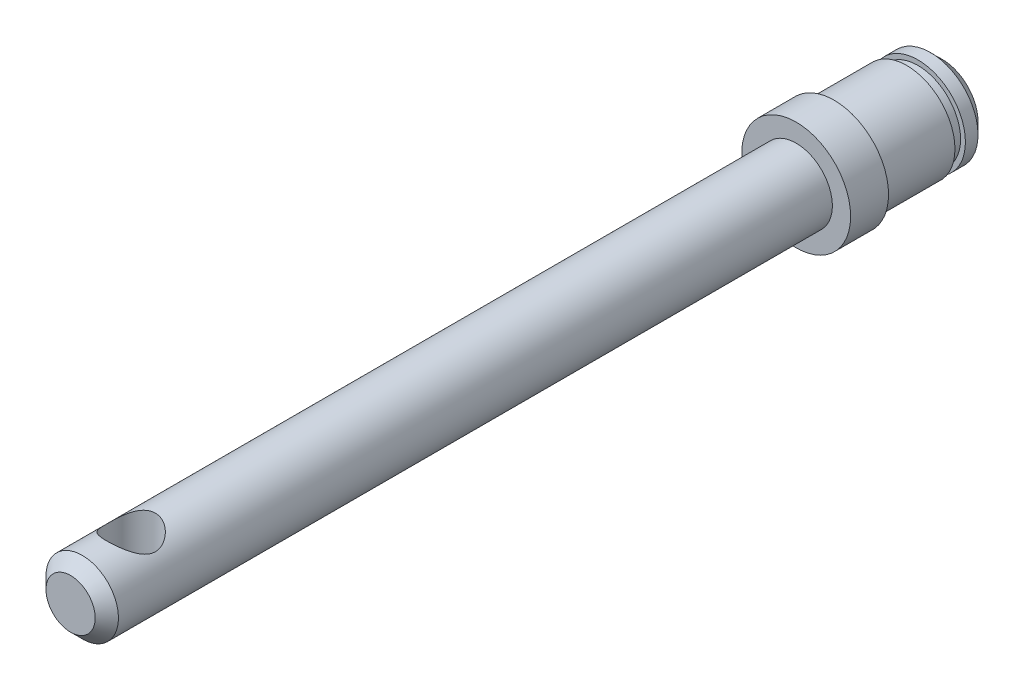
ISO-10303-21;
HEADER;
FILE_DESCRIPTION(('STEP AP214'),'2;1');
FILE_NAME('part.step','',(''),(''),'','','');
FILE_SCHEMA(('AUTOMOTIVE_DESIGN { 1 0 10303 214 1 1 1 1 }'));
ENDSEC;
DATA;
#1=APPLICATION_CONTEXT('core data for automotive mechanical design processes');
#2=APPLICATION_PROTOCOL_DEFINITION('international standard','automotive_design',2000,#1);
#3=PRODUCT_CONTEXT('',#1,'mechanical');
#4=PRODUCT('Part','Part','',(#3));
#5=PRODUCT_RELATED_PRODUCT_CATEGORY('part','',(#4));
#6=PRODUCT_DEFINITION_FORMATION('','',#4);
#7=PRODUCT_DEFINITION_CONTEXT('part definition',#1,'design');
#8=PRODUCT_DEFINITION('design','',#6,#7);
#9=PRODUCT_DEFINITION_SHAPE('','',#8);
#10=(LENGTH_UNIT() NAMED_UNIT(*) SI_UNIT(.MILLI.,.METRE.));
#11=(NAMED_UNIT(*) PLANE_ANGLE_UNIT() SI_UNIT($,.RADIAN.));
#12=(NAMED_UNIT(*) SI_UNIT($,.STERADIAN.) SOLID_ANGLE_UNIT());
#13=UNCERTAINTY_MEASURE_WITH_UNIT(LENGTH_MEASURE(1.E-05),#10,'distance_accuracy_value','');
#14=(GEOMETRIC_REPRESENTATION_CONTEXT(3) GLOBAL_UNCERTAINTY_ASSIGNED_CONTEXT((#13)) GLOBAL_UNIT_ASSIGNED_CONTEXT((#10,
#11,#12)) REPRESENTATION_CONTEXT('',''));
#15=CARTESIAN_POINT('',(0.,0.,0.));
#16=DIRECTION('',(0.,0.,1.));
#17=DIRECTION('',(1.,0.,0.));
#18=AXIS2_PLACEMENT_3D('',#15,#16,#17);
#19=CARTESIAN_POINT('',(0.,0.,-9.5758));
#20=DIRECTION('',(0.,0.,-1.));
#21=DIRECTION('',(-1.,0.,0.));
#22=AXIS2_PLACEMENT_3D('',#19,#20,#21);
#23=PLANE('',#22);
#24=CARTESIAN_POINT('',(0.,0.,-9.57579999993641));
#25=DIRECTION('',(0.,0.,1.));
#26=DIRECTION('',(1.,0.,0.));
#27=AXIS2_PLACEMENT_3D('',#24,#25,#26);
#28=CIRCLE('',#27,2.3494999999798);
#29=CARTESIAN_POINT('',(2.3494999999798,0.,-9.57579999993641));
#30=VERTEX_POINT('',#29);
#31=EDGE_CURVE('E17',#30,#30,#28,.T.);
#32=ORIENTED_EDGE('',*,*,#31,.F.);
#33=EDGE_LOOP('',(#32));
#34=FACE_BOUND('',#33,.T.);
#35=ADVANCED_FACE('F14',(#34),#23,.T.);
#36=CARTESIAN_POINT('',(0.,0.,-8.81380000009813));
#37=DIRECTION('',(0.,0.,1.));
#38=DIRECTION('',(1.,0.,0.));
#39=AXIS2_PLACEMENT_3D('',#36,#37,#38);
#40=CONICAL_SURFACE('',#39,3.11149999987492,0.785398163434747);
#41=ORIENTED_EDGE('',*,*,#31,.T.);
#42=EDGE_LOOP('',(#41));
#43=FACE_BOUND('',#42,.T.);
#44=CARTESIAN_POINT('',(0.,0.,-8.8138));
#45=DIRECTION('',(0.,0.,1.));
#46=DIRECTION('',(1.,0.,0.));
#47=AXIS2_PLACEMENT_3D('',#44,#45,#46);
#48=CIRCLE('',#47,3.1115);
#49=CARTESIAN_POINT('',(3.1115,0.,-8.8138));
#50=VERTEX_POINT('',#49);
#51=EDGE_CURVE('E33',#50,#50,#48,.T.);
#52=ORIENTED_EDGE('',*,*,#51,.F.);
#53=EDGE_LOOP('',(#52));
#54=FACE_BOUND('',#53,.T.);
#55=ADVANCED_FACE('F79',(#43,#54),#40,.T.);
#56=CARTESIAN_POINT('',(0.,0.,-9.5758));
#57=DIRECTION('',(0.,0.,1.));
#58=DIRECTION('',(1.,0.,0.));
#59=AXIS2_PLACEMENT_3D('',#56,#57,#58);
#60=CYLINDRICAL_SURFACE('',#59,3.1115);
#61=ORIENTED_EDGE('',*,*,#51,.T.);
#62=EDGE_LOOP('',(#61));
#63=FACE_BOUND('',#62,.T.);
#64=CARTESIAN_POINT('',(0.,0.,-7.9883));
#65=DIRECTION('',(0.,0.,1.));
#66=DIRECTION('',(1.,0.,0.));
#67=AXIS2_PLACEMENT_3D('',#64,#65,#66);
#68=CIRCLE('',#67,3.1115);
#69=CARTESIAN_POINT('',(3.1115,0.,-7.9883));
#70=VERTEX_POINT('',#69);
#71=EDGE_CURVE('E69',#70,#70,#68,.F.);
#72=ORIENTED_EDGE('',*,*,#71,.T.);
#73=EDGE_LOOP('',(#72));
#74=FACE_BOUND('',#73,.T.);
#75=ADVANCED_FACE('F87',(#63,#74),#60,.T.);
#76=CARTESIAN_POINT('',(0.,0.,-7.9883));
#77=DIRECTION('',(0.,0.,-1.));
#78=DIRECTION('',(-1.,0.,0.));
#79=AXIS2_PLACEMENT_3D('',#76,#77,#78);
#80=PLANE('',#79);
#81=CARTESIAN_POINT('',(0.,0.,-7.9883));
#82=DIRECTION('',(0.,0.,1.));
#83=DIRECTION('',(1.,0.,0.));
#84=AXIS2_PLACEMENT_3D('',#81,#82,#83);
#85=CIRCLE('',#84,2.794);
#86=CARTESIAN_POINT('',(2.794,0.,-7.9883));
#87=VERTEX_POINT('',#86);
#88=EDGE_CURVE('E67',#87,#87,#85,.T.);
#89=ORIENTED_EDGE('',*,*,#88,.F.);
#90=EDGE_LOOP('',(#89));
#91=FACE_BOUND('',#90,.T.);
#92=ORIENTED_EDGE('',*,*,#71,.F.);
#93=EDGE_LOOP('',(#92));
#94=FACE_BOUND('',#93,.T.);
#95=ADVANCED_FACE('F91',(#91,#94),#80,.F.);
#96=CARTESIAN_POINT('',(0.,0.,-7.9883));
#97=DIRECTION('',(0.,0.,1.));
#98=DIRECTION('',(1.,0.,0.));
#99=AXIS2_PLACEMENT_3D('',#96,#97,#98);
#100=CYLINDRICAL_SURFACE('',#99,2.794);
#101=CARTESIAN_POINT('',(0.,0.,-7.2517));
#102=DIRECTION('',(0.,0.,1.));
#103=DIRECTION('',(1.,0.,0.));
#104=AXIS2_PLACEMENT_3D('',#101,#102,#103);
#105=CIRCLE('',#104,2.794);
#106=CARTESIAN_POINT('',(2.794,0.,-7.2517));
#107=VERTEX_POINT('',#106);
#108=EDGE_CURVE('E64',#107,#107,#105,.T.);
#109=ORIENTED_EDGE('',*,*,#108,.F.);
#110=EDGE_LOOP('',(#109));
#111=FACE_BOUND('',#110,.T.);
#112=ORIENTED_EDGE('',*,*,#88,.T.);
#113=EDGE_LOOP('',(#112));
#114=FACE_BOUND('',#113,.T.);
#115=ADVANCED_FACE('F96',(#111,#114),#100,.T.);
#116=CARTESIAN_POINT('',(0.,0.,-7.2517));
#117=DIRECTION('',(0.,0.,-1.));
#118=DIRECTION('',(-1.,0.,0.));
#119=AXIS2_PLACEMENT_3D('',#116,#117,#118);
#120=PLANE('',#119);
#121=ORIENTED_EDGE('',*,*,#108,.T.);
#122=EDGE_LOOP('',(#121));
#123=FACE_BOUND('',#122,.T.);
#124=CARTESIAN_POINT('',(0.,0.,-7.2517));
#125=DIRECTION('',(0.,0.,1.));
#126=DIRECTION('',(1.,0.,0.));
#127=AXIS2_PLACEMENT_3D('',#124,#125,#126);
#128=CIRCLE('',#127,3.1623);
#129=CARTESIAN_POINT('',(3.1623,0.,-7.2517));
#130=VERTEX_POINT('',#129);
#131=EDGE_CURVE('E61',#130,#130,#128,.T.);
#132=ORIENTED_EDGE('',*,*,#131,.F.);
#133=EDGE_LOOP('',(#132));
#134=FACE_BOUND('',#133,.T.);
#135=ADVANCED_FACE('F100',(#123,#134),#120,.T.);
#136=CARTESIAN_POINT('',(0.,0.,-7.2517));
#137=DIRECTION('',(0.,0.,1.));
#138=DIRECTION('',(1.,0.,0.));
#139=AXIS2_PLACEMENT_3D('',#136,#137,#138);
#140=CYLINDRICAL_SURFACE('',#139,3.1623);
#141=ORIENTED_EDGE('',*,*,#131,.T.);
#142=EDGE_LOOP('',(#141));
#143=FACE_BOUND('',#142,.T.);
#144=CARTESIAN_POINT('',(0.,0.,-2.4892));
#145=DIRECTION('',(0.,0.,1.));
#146=DIRECTION('',(1.,0.,0.));
#147=AXIS2_PLACEMENT_3D('',#144,#145,#146);
#148=CIRCLE('',#147,3.1623);
#149=CARTESIAN_POINT('',(3.1623,0.,-2.4892));
#150=VERTEX_POINT('',#149);
#151=EDGE_CURVE('E58',#150,#150,#148,.F.);
#152=ORIENTED_EDGE('',*,*,#151,.T.);
#153=EDGE_LOOP('',(#152));
#154=FACE_BOUND('',#153,.T.);
#155=ADVANCED_FACE('F104',(#143,#154),#140,.T.);
#156=CARTESIAN_POINT('',(0.,0.,-2.4892));
#157=DIRECTION('',(0.,0.,1.));
#158=DIRECTION('',(1.,0.,0.));
#159=AXIS2_PLACEMENT_3D('',#156,#157,#158);
#160=PLANE('',#159);
#161=ORIENTED_EDGE('',*,*,#151,.F.);
#162=EDGE_LOOP('',(#161));
#163=FACE_BOUND('',#162,.T.);
#164=CARTESIAN_POINT('',(0.,0.,-2.4892));
#165=DIRECTION('',(0.,0.,1.));
#166=DIRECTION('',(1.,0.,0.));
#167=AXIS2_PLACEMENT_3D('',#164,#165,#166);
#168=CIRCLE('',#167,3.571875);
#169=CARTESIAN_POINT('',(3.571875,0.,-2.4892));
#170=VERTEX_POINT('',#169);
#171=EDGE_CURVE('E55',#170,#170,#168,.T.);
#172=ORIENTED_EDGE('',*,*,#171,.F.);
#173=EDGE_LOOP('',(#172));
#174=FACE_BOUND('',#173,.T.);
#175=ADVANCED_FACE('F108',(#163,#174),#160,.F.);
#176=CARTESIAN_POINT('',(0.,0.,47.5742));
#177=DIRECTION('',(0.,0.,1.));
#178=DIRECTION('',(1.,0.,0.));
#179=AXIS2_PLACEMENT_3D('',#176,#177,#178);
#180=PLANE('',#179);
#181=CARTESIAN_POINT('',(0.,0.,47.5741999999855));
#182=DIRECTION('',(0.,0.,-1.));
#183=DIRECTION('',(-1.,0.,0.));
#184=AXIS2_PLACEMENT_3D('',#181,#182,#183);
#185=CIRCLE('',#184,1.61289999999781);
#186=CARTESIAN_POINT('',(-1.61289999999781,0.,47.5741999999855));
#187=VERTEX_POINT('',#186);
#188=EDGE_CURVE('E52',#187,#187,#185,.T.);
#189=ORIENTED_EDGE('',*,*,#188,.F.);
#190=EDGE_LOOP('',(#189));
#191=FACE_BOUND('',#190,.T.);
#192=ADVANCED_FACE('F112',(#191),#180,.T.);
#193=CARTESIAN_POINT('',(0.,0.,-2.4892));
#194=DIRECTION('',(0.,0.,1.));
#195=DIRECTION('',(1.,0.,0.));
#196=AXIS2_PLACEMENT_3D('',#193,#194,#195);
#197=CYLINDRICAL_SURFACE('',#196,3.571875);
#198=ORIENTED_EDGE('',*,*,#171,.T.);
#199=EDGE_LOOP('',(#198));
#200=FACE_BOUND('',#199,.T.);
#201=CARTESIAN_POINT('',(0.,0.,0.));
#202=DIRECTION('',(0.,0.,1.));
#203=DIRECTION('',(1.,0.,0.));
#204=AXIS2_PLACEMENT_3D('',#201,#202,#203);
#205=CIRCLE('',#204,3.571875);
#206=CARTESIAN_POINT('',(3.571875,0.,0.));
#207=VERTEX_POINT('',#206);
#208=EDGE_CURVE('E49',#207,#207,#205,.T.);
#209=ORIENTED_EDGE('',*,*,#208,.F.);
#210=EDGE_LOOP('',(#209));
#211=FACE_BOUND('',#210,.T.);
#212=ADVANCED_FACE('F116',(#200,#211),#197,.T.);
#213=CARTESIAN_POINT('',(0.,0.,46.8121999999767));
#214=DIRECTION('',(0.,0.,-1.));
#215=DIRECTION('',(-1.,0.,0.));
#216=AXIS2_PLACEMENT_3D('',#213,#214,#215);
#217=CONICAL_SURFACE('',#216,2.37490000000662,0.785398163397448);
#218=ORIENTED_EDGE('',*,*,#188,.T.);
#219=EDGE_LOOP('',(#218));
#220=FACE_BOUND('',#219,.T.);
#221=CARTESIAN_POINT('',(0.,0.,46.8122));
#222=DIRECTION('',(0.,0.,-1.));
#223=DIRECTION('',(-1.,0.,0.));
#224=AXIS2_PLACEMENT_3D('',#221,#222,#223);
#225=CIRCLE('',#224,2.3749);
#226=CARTESIAN_POINT('',(-2.3749,0.,46.8122));
#227=VERTEX_POINT('',#226);
#228=EDGE_CURVE('E26',#227,#227,#225,.T.);
#229=ORIENTED_EDGE('',*,*,#228,.F.);
#230=EDGE_LOOP('',(#229));
#231=FACE_BOUND('',#230,.T.);
#232=ADVANCED_FACE('F120',(#220,#231),#217,.T.);
#233=CARTESIAN_POINT('',(0.,0.,0.));
#234=DIRECTION('',(0.,0.,1.));
#235=DIRECTION('',(1.,0.,0.));
#236=AXIS2_PLACEMENT_3D('',#233,#234,#235);
#237=PLANE('',#236);
#238=CARTESIAN_POINT('',(0.,0.,0.));
#239=DIRECTION('',(0.,0.,-1.));
#240=DIRECTION('',(-1.,0.,0.));
#241=AXIS2_PLACEMENT_3D('',#238,#239,#240);
#242=CIRCLE('',#241,2.3749);
#243=CARTESIAN_POINT('',(-2.3749,0.,0.));
#244=VERTEX_POINT('',#243);
#245=EDGE_CURVE('E21',#244,#244,#242,.F.);
#246=ORIENTED_EDGE('',*,*,#245,.F.);
#247=EDGE_LOOP('',(#246));
#248=FACE_BOUND('',#247,.T.);
#249=ORIENTED_EDGE('',*,*,#208,.T.);
#250=EDGE_LOOP('',(#249));
#251=FACE_BOUND('',#250,.T.);
#252=ADVANCED_FACE('F123',(#248,#251),#237,.T.);
#253=CARTESIAN_POINT('',(0.,-3.571875,43.60545));
#254=DIRECTION('',(0.,1.,0.));
#255=DIRECTION('',(0.,0.,1.));
#256=AXIS2_PLACEMENT_3D('',#253,#254,#255);
#257=CYLINDRICAL_SURFACE('',#256,1.5875);
#258=CARTESIAN_POINT('',(0.,2.3749,45.19295));
#259=CARTESIAN_POINT('',(-0.0796285021727966,2.37489427166207,45.1929439134093));
#260=CARTESIAN_POINT('',(-0.159333187346092,2.3708547437601,45.1869178453679));
#261=CARTESIAN_POINT('',(-0.316246788253907,2.35507625489168,45.1631617849446));
#262=CARTESIAN_POINT('',(-0.393451638249593,2.34332535323937,45.1454136412255));
#263=CARTESIAN_POINT('',(-0.542790518515763,2.31328830758023,45.0993083312295));
#264=CARTESIAN_POINT('',(-0.614948378456795,2.29503576257873,45.0710056736267));
#265=CARTESIAN_POINT('',(-0.753178545236462,2.25346165524091,45.0050040485006));
#266=CARTESIAN_POINT('',(-0.819251194999285,2.23014037879558,44.9673056109087));
#267=CARTESIAN_POINT('',(-0.949807131451189,2.17792784028168,44.8800881288627));
#268=CARTESIAN_POINT('',(-1.01367601133952,2.14873138397025,44.8298358883516));
#269=CARTESIAN_POINT('',(-1.13266066753279,2.0884656766868,44.7206931180195));
#270=CARTESIAN_POINT('',(-1.18776336726205,2.05739372150985,44.6617899306125));
#271=CARTESIAN_POINT('',(-1.29659427145063,1.99089626995362,44.5261680967343));
#272=CARTESIAN_POINT('',(-1.34871636553572,1.95556248733199,44.4481056626616));
#273=CARTESIAN_POINT('',(-1.43904349853149,1.89008374794265,44.2823403381314));
#274=CARTESIAN_POINT('',(-1.4772725865024,1.85992987284409,44.1946544520516));
#275=CARTESIAN_POINT('',(-1.52904517834333,1.81740283377534,44.0377472795276));
#276=CARTESIAN_POINT('',(-1.54653236351236,1.80240921282223,43.9705447171603));
#277=CARTESIAN_POINT('',(-1.57261168441343,1.77970474695812,43.8332848433952));
#278=CARTESIAN_POINT('',(-1.58121930044462,1.7719812296935,43.763232722255));
#279=CARTESIAN_POINT('',(-1.58899802612375,1.76501215254764,43.6218716388384));
#280=CARTESIAN_POINT('',(-1.58812985724121,1.76580188116326,43.5505586693621));
#281=CARTESIAN_POINT('',(-1.57692650593038,1.77581049841768,43.4092572197684));
#282=CARTESIAN_POINT('',(-1.56658327442516,1.7850365537139,43.3392699174096));
#283=CARTESIAN_POINT('',(-1.53778680769931,1.80988877384798,43.2056567626746));
#284=CARTESIAN_POINT('',(-1.51972103829905,1.82520699487101,43.1418863605764));
#285=CARTESIAN_POINT('',(-1.47635800673587,1.86045582345457,43.0182351850859));
#286=CARTESIAN_POINT('',(-1.45105836975688,1.88038794530891,42.9583556969829));
#287=CARTESIAN_POINT('',(-1.38804369169894,1.92751840139636,42.8311724358925));
#288=CARTESIAN_POINT('',(-1.34884877883874,1.95536954816995,42.7648460457442));
#289=CARTESIAN_POINT('',(-1.26169992826936,2.01270750683002,42.6389401049234));
#290=CARTESIAN_POINT('',(-1.21373539144903,2.04219626760565,42.5793688613398));
#291=CARTESIAN_POINT('',(-1.09822042057742,2.10697571698643,42.4553504562286));
#292=CARTESIAN_POINT('',(-1.02867941502371,2.14213147691545,42.3926663982129));
#293=CARTESIAN_POINT('',(-0.87829590652397,2.20804612806214,42.2797162875604));
#294=CARTESIAN_POINT('',(-0.797461070213304,2.23880797360637,42.2294418743602));
#295=CARTESIAN_POINT('',(-0.642794196366182,2.28740091649053,42.151857840345));
#296=CARTESIAN_POINT('',(-0.570673934887535,2.30658392602361,42.1219812810788));
#297=CARTESIAN_POINT('',(-0.421590346714549,2.33841465201831,42.0729550712348));
#298=CARTESIAN_POINT('',(-0.344638477425361,2.35107721947041,42.05378103609));
#299=CARTESIAN_POINT('',(-0.222529004084351,2.36486476954346,42.0329936390966));
#300=CARTESIAN_POINT('',(-0.178308116016056,2.36861511899109,42.0273651451537));
#301=CARTESIAN_POINT('',(-0.0893995612791168,2.37363462559172,42.0198411908061));
#302=CARTESIAN_POINT('',(-0.0447117904210668,2.37490321648955,42.0179465823498));
#303=CARTESIAN_POINT('',(0.0796285021727959,2.37489427166207,42.0179560865907));
#304=CARTESIAN_POINT('',(0.159333187346092,2.3708547437601,42.0239821546321));
#305=CARTESIAN_POINT('',(0.316246788253906,2.35507625489168,42.0477382150553));
#306=CARTESIAN_POINT('',(0.393451638249593,2.34332535323937,42.0654863587745));
#307=CARTESIAN_POINT('',(0.542790518515763,2.31328830758023,42.1115916687705));
#308=CARTESIAN_POINT('',(0.614948378456795,2.29503576257873,42.1398943263733));
#309=CARTESIAN_POINT('',(0.753178545236463,2.25346165524091,42.2058959514994));
#310=CARTESIAN_POINT('',(0.819251194999285,2.23014037879558,42.2435943890913));
#311=CARTESIAN_POINT('',(0.949807131451189,2.17792784028168,42.3308118711373));
#312=CARTESIAN_POINT('',(1.01367601133952,2.14873138397025,42.3810641116484));
#313=CARTESIAN_POINT('',(1.13266066753279,2.0884656766868,42.4902068819805));
#314=CARTESIAN_POINT('',(1.18776336726205,2.05739372150985,42.5491100693874));
#315=CARTESIAN_POINT('',(1.29659427145063,1.99089626995362,42.6847319032657));
#316=CARTESIAN_POINT('',(1.34871636553572,1.95556248733199,42.7627943373384));
#317=CARTESIAN_POINT('',(1.43904349853149,1.89008374794265,42.9285596618686));
#318=CARTESIAN_POINT('',(1.4772725865024,1.85992987284409,43.0162455479484));
#319=CARTESIAN_POINT('',(1.52904517834333,1.81740283377534,43.1731527204724));
#320=CARTESIAN_POINT('',(1.54653236351236,1.80240921282223,43.2403552828397));
#321=CARTESIAN_POINT('',(1.57261168441343,1.77970474695812,43.3776151566048));
#322=CARTESIAN_POINT('',(1.58121930044462,1.7719812296935,43.447667277745));
#323=CARTESIAN_POINT('',(1.58899802612375,1.76501215254764,43.5890283611616));
#324=CARTESIAN_POINT('',(1.58812985724121,1.76580188116326,43.6603413306379));
#325=CARTESIAN_POINT('',(1.57692650593038,1.77581049841768,43.8016427802316));
#326=CARTESIAN_POINT('',(1.56658327442517,1.7850365537139,43.8716300825904));
#327=CARTESIAN_POINT('',(1.53778680769931,1.80988877384798,44.0052432373254));
#328=CARTESIAN_POINT('',(1.51972103829905,1.825206994871,44.0690136394236));
#329=CARTESIAN_POINT('',(1.47635800673587,1.86045582345457,44.192664814914));
#330=CARTESIAN_POINT('',(1.45105836975689,1.88038794530891,44.2525443030171));
#331=CARTESIAN_POINT('',(1.38804369169894,1.92751840139636,44.3797275641075));
#332=CARTESIAN_POINT('',(1.34884877883874,1.95536954816995,44.4460539542558));
#333=CARTESIAN_POINT('',(1.26169992826936,2.01270750683002,44.5719598950766));
#334=CARTESIAN_POINT('',(1.21373539144903,2.04219626760564,44.6315311386602));
#335=CARTESIAN_POINT('',(1.09822042057742,2.10697571698643,44.7555495437714));
#336=CARTESIAN_POINT('',(1.02867941502371,2.14213147691544,44.8182336017871));
#337=CARTESIAN_POINT('',(0.87829590652398,2.20804612806214,44.9311837124396));
#338=CARTESIAN_POINT('',(0.797461070213316,2.23880797360636,44.9814581256398));
#339=CARTESIAN_POINT('',(0.642794196366197,2.28740091649053,45.059042159655));
#340=CARTESIAN_POINT('',(0.57067393488755,2.30658392602361,45.0889187189212));
#341=CARTESIAN_POINT('',(0.421590346714565,2.33841465201831,45.1379449287651));
#342=CARTESIAN_POINT('',(0.344638477425378,2.3510772194704,45.15711896391));
#343=CARTESIAN_POINT('',(0.222529004084365,2.36486476954346,45.1779063609034));
#344=CARTESIAN_POINT('',(0.178308116016067,2.36861511899109,45.1835348548463));
#345=CARTESIAN_POINT('',(0.0893995612791212,2.37363462559172,45.1910588091939));
#346=CARTESIAN_POINT('',(0.0447117904210687,2.37490321648955,45.1929534176502));
#347=CARTESIAN_POINT('',(0.,2.3749,45.19295));
#348=B_SPLINE_CURVE_WITH_KNOTS('',3,(#258,#259,#260,#261,#262,#263,#264,#265,#266,#267,#268,
#269,#270,#271,#272,#273,#274,#275,#276,#277,#278,#279,#280,#281,#282,#283,#284,#285,#286,#287,
#288,#289,#290,#291,#292,#293,#294,#295,#296,#297,#298,#299,#300,#301,#302,#303,#304,#305,#306,
#307,#308,#309,#310,#311,#312,#313,#314,#315,#316,#317,#318,#319,#320,#321,#322,#323,#324,#325,
#326,#327,#328,#329,#330,#331,#332,#333,#334,#335,#336,#337,#338,#339,#340,#341,#342,#343,#344,
#345,#346,#347),.UNSPECIFIED.,.T.,.F.,(4,2,2,2,2,2,2,2,2,2,2,2,2,2,2,2,2,2,2,2,2,2,2,2,2,2,2,2,
2,2,2,2,2,2,2,2,2,2,2,2,2,2,2,2,4),(0.,0.238700395852421,0.477771282535445,0.71562421428543,
0.95346373392742,1.21155549797826,1.47002872073382,1.76952408912618,2.06849852769238,
2.28077891750231,2.49268859719911,2.70547700634111,2.9184463472867,3.12179507761272,
3.32521064236503,3.57012288877609,3.815333120713,4.1139409115089,4.41234697329097,
4.65252034508975,4.89214425005817,5.02614510978654,5.16017654051243,5.39887693636485,
5.63794782304788,5.87580075479786,6.11364027443985,6.37173203849069,6.63020526124625,
6.92970062963861,7.22867506820481,7.44095545801474,7.65286513771153,7.86565354685354,
8.07862288779913,8.28197161812515,8.48538718287745,8.73029942928851,8.97550966122542,
9.27411745202132,9.57252351380338,9.81269688560216,10.0523207905706,10.186321650299,
10.3203530810249),.UNSPECIFIED.);
#349=CARTESIAN_POINT('',(0.,2.3749,45.19295));
#350=VERTEX_POINT('',#349);
#351=EDGE_CURVE('E44',#350,#350,#348,.T.);
#352=ORIENTED_EDGE('',*,*,#351,.F.);
#353=EDGE_LOOP('',(#352));
#354=FACE_BOUND('',#353,.T.);
#355=CARTESIAN_POINT('',(0.,-2.3749,45.19295));
#356=CARTESIAN_POINT('',(0.079628502172797,-2.37489427166208,45.1929439134093));
#357=CARTESIAN_POINT('',(0.159333187346093,-2.3708547437601,45.1869178453679));
#358=CARTESIAN_POINT('',(0.316246788253907,-2.35507625489168,45.1631617849446));
#359=CARTESIAN_POINT('',(0.393451638249594,-2.34332535323937,45.1454136412255));
#360=CARTESIAN_POINT('',(0.542790518515763,-2.31328830758023,45.0993083312295));
#361=CARTESIAN_POINT('',(0.614948378456796,-2.29503576257873,45.0710056736267));
#362=CARTESIAN_POINT('',(0.753178545236462,-2.25346165524091,45.0050040485006));
#363=CARTESIAN_POINT('',(0.819251194999285,-2.23014037879558,44.9673056109087));
#364=CARTESIAN_POINT('',(0.949807131451189,-2.17792784028168,44.8800881288627));
#365=CARTESIAN_POINT('',(1.01367601133952,-2.14873138397025,44.8298358883516));
#366=CARTESIAN_POINT('',(1.13266066753279,-2.0884656766868,44.7206931180195));
#367=CARTESIAN_POINT('',(1.18776336726205,-2.05739372150985,44.6617899306125));
#368=CARTESIAN_POINT('',(1.29659427145063,-1.99089626995362,44.5261680967343));
#369=CARTESIAN_POINT('',(1.34871636553572,-1.95556248733199,44.4481056626616));
#370=CARTESIAN_POINT('',(1.43904349853149,-1.89008374794265,44.2823403381314));
#371=CARTESIAN_POINT('',(1.4772725865024,-1.85992987284409,44.1946544520516));
#372=CARTESIAN_POINT('',(1.52904517834333,-1.81740283377534,44.0377472795276));
#373=CARTESIAN_POINT('',(1.54653236351237,-1.80240921282223,43.9705447171602));
#374=CARTESIAN_POINT('',(1.57261168441344,-1.77970474695812,43.8332848433952));
#375=CARTESIAN_POINT('',(1.58121930044462,-1.7719812296935,43.763232722255));
#376=CARTESIAN_POINT('',(1.58899802612375,-1.76501215254764,43.6218716388384));
#377=CARTESIAN_POINT('',(1.58812985724121,-1.76580188116326,43.5505586693621));
#378=CARTESIAN_POINT('',(1.57692650593038,-1.77581049841768,43.4092572197684));
#379=CARTESIAN_POINT('',(1.56658327442516,-1.7850365537139,43.3392699174096));
#380=CARTESIAN_POINT('',(1.53778680769931,-1.80988877384798,43.2056567626746));
#381=CARTESIAN_POINT('',(1.51972103829905,-1.82520699487101,43.1418863605764));
#382=CARTESIAN_POINT('',(1.47635800673587,-1.86045582345457,43.0182351850859));
#383=CARTESIAN_POINT('',(1.45105836975688,-1.88038794530891,42.9583556969829));
#384=CARTESIAN_POINT('',(1.38804369169894,-1.92751840139636,42.8311724358925));
#385=CARTESIAN_POINT('',(1.34884877883874,-1.95536954816995,42.7648460457442));
#386=CARTESIAN_POINT('',(1.26169992826936,-2.01270750683002,42.6389401049234));
#387=CARTESIAN_POINT('',(1.21373539144903,-2.04219626760565,42.5793688613398));
#388=CARTESIAN_POINT('',(1.09822042057742,-2.10697571698643,42.4553504562286));
#389=CARTESIAN_POINT('',(1.0286794150237,-2.14213147691545,42.3926663982129));
#390=CARTESIAN_POINT('',(0.878295906523966,-2.20804612806214,42.2797162875604));
#391=CARTESIAN_POINT('',(0.797461070213302,-2.23880797360637,42.2294418743602));
#392=CARTESIAN_POINT('',(0.642794196366183,-2.28740091649053,42.151857840345));
#393=CARTESIAN_POINT('',(0.570673934887537,-2.30658392602361,42.1219812810788));
#394=CARTESIAN_POINT('',(0.421590346714551,-2.33841465201831,42.0729550712348));
#395=CARTESIAN_POINT('',(0.344638477425362,-2.35107721947041,42.05378103609));
#396=CARTESIAN_POINT('',(0.22252900408435,-2.36486476954346,42.0329936390966));
#397=CARTESIAN_POINT('',(0.178308116016056,-2.36861511899109,42.0273651451537));
#398=CARTESIAN_POINT('',(0.0893995612791169,-2.37363462559172,42.0198411908061));
#399=CARTESIAN_POINT('',(0.0447117904210671,-2.37490321648955,42.0179465823498));
#400=CARTESIAN_POINT('',(-0.0796285021727957,-2.37489427166208,42.0179560865907));
#401=CARTESIAN_POINT('',(-0.159333187346092,-2.3708547437601,42.0239821546321));
#402=CARTESIAN_POINT('',(-0.316246788253906,-2.35507625489168,42.0477382150553));
#403=CARTESIAN_POINT('',(-0.393451638249593,-2.34332535323937,42.0654863587745));
#404=CARTESIAN_POINT('',(-0.542790518515762,-2.31328830758023,42.1115916687705));
#405=CARTESIAN_POINT('',(-0.614948378456795,-2.29503576257873,42.1398943263733));
#406=CARTESIAN_POINT('',(-0.753178545236462,-2.25346165524091,42.2058959514994));
#407=CARTESIAN_POINT('',(-0.819251194999284,-2.23014037879558,42.2435943890913));
#408=CARTESIAN_POINT('',(-0.949807131451189,-2.17792784028168,42.3308118711373));
#409=CARTESIAN_POINT('',(-1.01367601133952,-2.14873138397025,42.3810641116484));
#410=CARTESIAN_POINT('',(-1.13266066753279,-2.0884656766868,42.4902068819805));
#411=CARTESIAN_POINT('',(-1.18776336726205,-2.05739372150985,42.5491100693874));
#412=CARTESIAN_POINT('',(-1.29659427145063,-1.99089626995362,42.6847319032657));
#413=CARTESIAN_POINT('',(-1.34871636553572,-1.95556248733199,42.7627943373384));
#414=CARTESIAN_POINT('',(-1.43904349853149,-1.89008374794265,42.9285596618686));
#415=CARTESIAN_POINT('',(-1.4772725865024,-1.85992987284409,43.0162455479484));
#416=CARTESIAN_POINT('',(-1.52904517834333,-1.81740283377534,43.1731527204724));
#417=CARTESIAN_POINT('',(-1.54653236351237,-1.80240921282223,43.2403552828398));
#418=CARTESIAN_POINT('',(-1.57261168441344,-1.77970474695812,43.3776151566048));
#419=CARTESIAN_POINT('',(-1.58121930044462,-1.7719812296935,43.447667277745));
#420=CARTESIAN_POINT('',(-1.58899802612375,-1.76501215254764,43.5890283611616));
#421=CARTESIAN_POINT('',(-1.58812985724121,-1.76580188116326,43.6603413306379));
#422=CARTESIAN_POINT('',(-1.57692650593038,-1.77581049841768,43.8016427802316));
#423=CARTESIAN_POINT('',(-1.56658327442516,-1.7850365537139,43.8716300825904));
#424=CARTESIAN_POINT('',(-1.53778680769931,-1.80988877384798,44.0052432373254));
#425=CARTESIAN_POINT('',(-1.51972103829905,-1.82520699487101,44.0690136394236));
#426=CARTESIAN_POINT('',(-1.47635800673587,-1.86045582345457,44.192664814914));
#427=CARTESIAN_POINT('',(-1.45105836975688,-1.88038794530891,44.2525443030171));
#428=CARTESIAN_POINT('',(-1.38804369169894,-1.92751840139636,44.3797275641075));
#429=CARTESIAN_POINT('',(-1.34884877883874,-1.95536954816995,44.4460539542558));
#430=CARTESIAN_POINT('',(-1.26169992826936,-2.01270750683002,44.5719598950766));
#431=CARTESIAN_POINT('',(-1.21373539144903,-2.04219626760565,44.6315311386602));
#432=CARTESIAN_POINT('',(-1.09822042057742,-2.10697571698643,44.7555495437714));
#433=CARTESIAN_POINT('',(-1.02867941502371,-2.14213147691544,44.8182336017871));
#434=CARTESIAN_POINT('',(-0.878295906523972,-2.20804612806214,44.9311837124396));
#435=CARTESIAN_POINT('',(-0.797461070213305,-2.23880797360637,44.9814581256398));
#436=CARTESIAN_POINT('',(-0.642794196366183,-2.28740091649053,45.059042159655));
#437=CARTESIAN_POINT('',(-0.570673934887537,-2.30658392602361,45.0889187189212));
#438=CARTESIAN_POINT('',(-0.421590346714551,-2.33841465201831,45.1379449287651));
#439=CARTESIAN_POINT('',(-0.344638477425362,-2.35107721947041,45.15711896391));
#440=CARTESIAN_POINT('',(-0.22252900408435,-2.36486476954346,45.1779063609034));
#441=CARTESIAN_POINT('',(-0.178308116016055,-2.36861511899109,45.1835348548463));
#442=CARTESIAN_POINT('',(-0.0893995612791154,-2.37363462559172,45.1910588091939));
#443=CARTESIAN_POINT('',(-0.0447117904210655,-2.37490321648955,45.1929534176502));
#444=CARTESIAN_POINT('',(0.,-2.3749,45.19295));
#445=B_SPLINE_CURVE_WITH_KNOTS('',3,(#355,#356,#357,#358,#359,#360,#361,#362,#363,#364,#365,
#366,#367,#368,#369,#370,#371,#372,#373,#374,#375,#376,#377,#378,#379,#380,#381,#382,#383,#384,
#385,#386,#387,#388,#389,#390,#391,#392,#393,#394,#395,#396,#397,#398,#399,#400,#401,#402,#403,
#404,#405,#406,#407,#408,#409,#410,#411,#412,#413,#414,#415,#416,#417,#418,#419,#420,#421,#422,
#423,#424,#425,#426,#427,#428,#429,#430,#431,#432,#433,#434,#435,#436,#437,#438,#439,#440,#441,
#442,#443,#444),.UNSPECIFIED.,.T.,.F.,(4,2,2,2,2,2,2,2,2,2,2,2,2,2,2,2,2,2,2,2,2,2,2,2,2,2,2,2,
2,2,2,2,2,2,2,2,2,2,2,2,2,2,2,2,4),(0.,0.238700395852421,0.477771282535445,0.71562421428543,
0.953463733927419,1.21155549797826,1.47002872073382,1.76952408912618,2.06849852769238,
2.28077891750232,2.49268859719911,2.70547700634111,2.9184463472867,3.12179507761272,
3.32521064236503,3.57012288877609,3.815333120713,4.11394091150891,4.41234697329097,
4.65252034508974,4.89214425005817,5.02614510978654,5.16017654051243,5.39887693636485,
5.63794782304788,5.87580075479786,6.11364027443985,6.37173203849069,6.63020526124625,
6.92970062963861,7.22867506820481,7.44095545801475,7.65286513771154,7.86565354685354,
8.07862288779913,8.28197161812515,8.48538718287746,8.73029942928852,8.97550966122543,
9.27411745202133,9.5725235138034,9.81269688560218,10.0523207905706,10.186321650299,
10.3203530810249),.UNSPECIFIED.);
#446=CARTESIAN_POINT('',(0.,-2.3749,45.19295));
#447=VERTEX_POINT('',#446);
#448=EDGE_CURVE('E10',#447,#447,#445,.T.);
#449=ORIENTED_EDGE('',*,*,#448,.F.);
#450=EDGE_LOOP('',(#449));
#451=FACE_BOUND('',#450,.T.);
#452=ADVANCED_FACE('F36',(#354,#451),#257,.F.);
#453=CARTESIAN_POINT('',(0.,0.,47.5742));
#454=DIRECTION('',(0.,0.,-1.));
#455=DIRECTION('',(-1.,0.,0.));
#456=AXIS2_PLACEMENT_3D('',#453,#454,#455);
#457=CYLINDRICAL_SURFACE('',#456,2.3749);
#458=ORIENTED_EDGE('',*,*,#228,.T.);
#459=EDGE_LOOP('',(#458));
#460=FACE_BOUND('',#459,.T.);
#461=ORIENTED_EDGE('',*,*,#448,.T.);
#462=EDGE_LOOP('',(#461));
#463=FACE_BOUND('',#462,.T.);
#464=ORIENTED_EDGE('',*,*,#245,.T.);
#465=EDGE_LOOP('',(#464));
#466=FACE_BOUND('',#465,.T.);
#467=ORIENTED_EDGE('',*,*,#351,.T.);
#468=EDGE_LOOP('',(#467));
#469=FACE_BOUND('',#468,.T.);
#470=ADVANCED_FACE('F39',(#460,#463,#466,#469),#457,.T.);
#471=CLOSED_SHELL('',(#35,#55,#75,#95,#115,#135,#155,#175,#192,#212,#232,#252,#452,#470));
#472=MANIFOLD_SOLID_BREP('B1',#471);
#473=ADVANCED_BREP_SHAPE_REPRESENTATION('',(#18,#472),#14);
#474=SHAPE_DEFINITION_REPRESENTATION(#9,#473);
ENDSEC;
END-ISO-10303-21;
